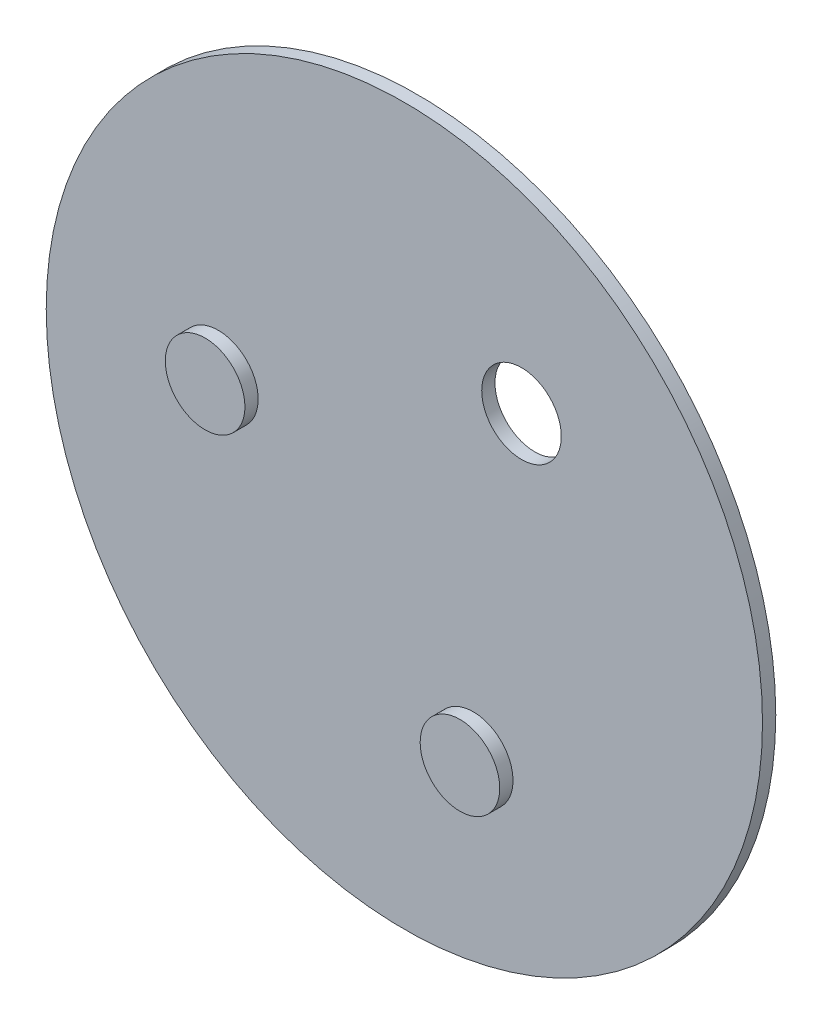
ISO-10303-21;
HEADER;
FILE_DESCRIPTION(('STEP AP214'),'2;1');
FILE_NAME('part.step','',(''),(''),'','','');
FILE_SCHEMA(('AUTOMOTIVE_DESIGN { 1 0 10303 214 1 1 1 1 }'));
ENDSEC;
DATA;
#1=APPLICATION_CONTEXT('core data for automotive mechanical design processes');
#2=APPLICATION_PROTOCOL_DEFINITION('international standard','automotive_design',2000,#1);
#3=PRODUCT_CONTEXT('',#1,'mechanical');
#4=PRODUCT('Part','Part','',(#3));
#5=PRODUCT_RELATED_PRODUCT_CATEGORY('part','',(#4));
#6=PRODUCT_DEFINITION_FORMATION('','',#4);
#7=PRODUCT_DEFINITION_CONTEXT('part definition',#1,'design');
#8=PRODUCT_DEFINITION('design','',#6,#7);
#9=PRODUCT_DEFINITION_SHAPE('','',#8);
#10=(LENGTH_UNIT() NAMED_UNIT(*) SI_UNIT(.MILLI.,.METRE.));
#11=(NAMED_UNIT(*) PLANE_ANGLE_UNIT() SI_UNIT($,.RADIAN.));
#12=(NAMED_UNIT(*) SI_UNIT($,.STERADIAN.) SOLID_ANGLE_UNIT());
#13=UNCERTAINTY_MEASURE_WITH_UNIT(LENGTH_MEASURE(1.E-05),#10,'distance_accuracy_value','');
#14=(GEOMETRIC_REPRESENTATION_CONTEXT(3) GLOBAL_UNCERTAINTY_ASSIGNED_CONTEXT((#13)) GLOBAL_UNIT_ASSIGNED_CONTEXT((#10,
#11,#12)) REPRESENTATION_CONTEXT('',''));
#15=CARTESIAN_POINT('',(0.,0.,0.));
#16=DIRECTION('',(0.,0.,1.));
#17=DIRECTION('',(1.,0.,0.));
#18=AXIS2_PLACEMENT_3D('',#15,#16,#17);
#19=CARTESIAN_POINT('',(-14.0219821608367,2.10189640877717,0.));
#20=DIRECTION('',(0.,0.,-1.));
#21=DIRECTION('',(-1.,0.,0.));
#22=AXIS2_PLACEMENT_3D('',#19,#20,#21);
#23=PLANE('',#22);
#24=CARTESIAN_POINT('',(-14.0219821608367,2.10189640877717,0.));
#25=DIRECTION('',(0.,0.,1.));
#26=DIRECTION('',(1.,0.,0.));
#27=AXIS2_PLACEMENT_3D('',#24,#25,#26);
#28=CIRCLE('',#27,3.0000000000011);
#29=CARTESIAN_POINT('',(-11.0219821608356,2.10189640877717,0.));
#30=VERTEX_POINT('',#29);
#31=EDGE_CURVE('P0_E18',#30,#30,#28,.F.);
#32=ORIENTED_EDGE('',*,*,#31,.F.);
#33=EDGE_LOOP('',(#32));
#34=FACE_BOUND('',#33,.T.);
#35=ADVANCED_FACE('P0_F15',(#34),#23,.F.);
#36=CARTESIAN_POINT('',(-14.0219821608367,2.10189640877717,-1.));
#37=DIRECTION('',(0.,0.,1.));
#38=DIRECTION('',(1.,0.,0.));
#39=AXIS2_PLACEMENT_3D('',#36,#37,#38);
#40=CYLINDRICAL_SURFACE('',#39,3.0000000000011);
#41=ORIENTED_EDGE('',*,*,#31,.T.);
#42=EDGE_LOOP('',(#41));
#43=FACE_BOUND('',#42,.T.);
#44=CARTESIAN_POINT('',(-14.0219821608367,2.10189640877717,-1.));
#45=DIRECTION('',(0.,0.,1.));
#46=DIRECTION('',(1.,0.,0.));
#47=AXIS2_PLACEMENT_3D('',#44,#45,#46);
#48=CIRCLE('',#47,3.0000000000011);
#49=CARTESIAN_POINT('',(-11.0219821608356,2.10189640877717,-1.));
#50=VERTEX_POINT('',#49);
#51=EDGE_CURVE('P0_E10',#50,#50,#48,.F.);
#52=ORIENTED_EDGE('',*,*,#51,.F.);
#53=EDGE_LOOP('',(#52));
#54=FACE_BOUND('',#53,.T.);
#55=ADVANCED_FACE('P0_F27',(#43,#54),#40,.T.);
#56=CARTESIAN_POINT('',(-14.0219821608367,2.10189640877717,-1.));
#57=DIRECTION('',(0.,0.,-1.));
#58=DIRECTION('',(-1.,0.,0.));
#59=AXIS2_PLACEMENT_3D('',#56,#57,#58);
#60=PLANE('',#59);
#61=ORIENTED_EDGE('',*,*,#51,.T.);
#62=EDGE_LOOP('',(#61));
#63=FACE_BOUND('',#62,.T.);
#64=ADVANCED_FACE('P0_F35',(#63),#60,.T.);
#65=CLOSED_SHELL('',(#35,#55,#64));
#66=MANIFOLD_SOLID_BREP('P0_B1',#65);
#67=CARTESIAN_POINT('',(5.19069539429365,-13.1943409670844,2.));
#68=DIRECTION('',(0.,0.,1.));
#69=DIRECTION('',(1.,0.,0.));
#70=AXIS2_PLACEMENT_3D('',#67,#68,#69);
#71=PLANE('',#70);
#72=CARTESIAN_POINT('',(5.19069539429365,-13.1943409670844,2.));
#73=DIRECTION('',(0.,0.,-1.));
#74=DIRECTION('',(-1.,0.,0.));
#75=AXIS2_PLACEMENT_3D('',#72,#73,#74);
#76=CIRCLE('',#75,3.00000000000078);
#77=CARTESIAN_POINT('',(2.19069539429287,-13.1943409670844,2.));
#78=VERTEX_POINT('',#77);
#79=EDGE_CURVE('P1_E18',#78,#78,#76,.T.);
#80=ORIENTED_EDGE('',*,*,#79,.F.);
#81=EDGE_LOOP('',(#80));
#82=FACE_BOUND('',#81,.T.);
#83=ADVANCED_FACE('P1_F15',(#82),#71,.T.);
#84=CARTESIAN_POINT('',(-14.0219821608367,2.10189640877717,2.));
#85=DIRECTION('',(0.,0.,1.));
#86=DIRECTION('',(1.,0.,0.));
#87=AXIS2_PLACEMENT_3D('',#84,#85,#86);
#88=PLANE('',#87);
#89=CARTESIAN_POINT('',(-14.0219821608367,2.10189640877717,2.));
#90=DIRECTION('',(0.,0.,-1.));
#91=DIRECTION('',(-1.,0.,0.));
#92=AXIS2_PLACEMENT_3D('',#89,#90,#91);
#93=CIRCLE('',#92,3.0000000000011);
#94=CARTESIAN_POINT('',(-17.0219821608378,2.10189640877717,2.));
#95=VERTEX_POINT('',#94);
#96=EDGE_CURVE('P1_E40',#95,#95,#93,.T.);
#97=ORIENTED_EDGE('',*,*,#96,.F.);
#98=EDGE_LOOP('',(#97));
#99=FACE_BOUND('',#98,.T.);
#100=ADVANCED_FACE('P1_F50',(#99),#88,.T.);
#101=CARTESIAN_POINT('',(5.19069539429365,-13.1943409670844,2.));
#102=DIRECTION('',(0.,0.,-1.));
#103=DIRECTION('',(-1.,0.,0.));
#104=AXIS2_PLACEMENT_3D('',#101,#102,#103);
#105=CYLINDRICAL_SURFACE('',#104,3.00000000000078);
#106=CARTESIAN_POINT('',(5.19069539429365,-13.1943409670844,0.999999999999999));
#107=DIRECTION('',(0.,0.,-1.));
#108=DIRECTION('',(-1.,0.,0.));
#109=AXIS2_PLACEMENT_3D('',#106,#107,#108);
#110=CIRCLE('',#109,3.00000000000078);
#111=CARTESIAN_POINT('',(2.19069539429287,-13.1943409670844,0.999999999999999));
#112=VERTEX_POINT('',#111);
#113=EDGE_CURVE('P1_E38',#112,#112,#110,.T.);
#114=ORIENTED_EDGE('',*,*,#113,.F.);
#115=EDGE_LOOP('',(#114));
#116=FACE_BOUND('',#115,.T.);
#117=ORIENTED_EDGE('',*,*,#79,.T.);
#118=EDGE_LOOP('',(#117));
#119=FACE_BOUND('',#118,.T.);
#120=ADVANCED_FACE('P1_F47',(#116,#119),#105,.T.);
#121=CARTESIAN_POINT('',(-14.0219821608367,2.10189640877717,2.));
#122=DIRECTION('',(0.,0.,-1.));
#123=DIRECTION('',(-1.,0.,0.));
#124=AXIS2_PLACEMENT_3D('',#121,#122,#123);
#125=CYLINDRICAL_SURFACE('',#124,3.0000000000011);
#126=CARTESIAN_POINT('',(-14.0219821608367,2.10189640877717,0.999999999999999));
#127=DIRECTION('',(0.,0.,-1.));
#128=DIRECTION('',(-1.,0.,0.));
#129=AXIS2_PLACEMENT_3D('',#126,#127,#128);
#130=CIRCLE('',#129,3.0000000000011);
#131=CARTESIAN_POINT('',(-17.0219821608378,2.10189640877717,0.999999999999999));
#132=VERTEX_POINT('',#131);
#133=EDGE_CURVE('P1_E35',#132,#132,#130,.T.);
#134=ORIENTED_EDGE('',*,*,#133,.F.);
#135=EDGE_LOOP('',(#134));
#136=FACE_BOUND('',#135,.T.);
#137=ORIENTED_EDGE('',*,*,#96,.T.);
#138=EDGE_LOOP('',(#137));
#139=FACE_BOUND('',#138,.T.);
#140=ADVANCED_FACE('P1_F75',(#136,#139),#125,.T.);
#141=CARTESIAN_POINT('',(0.,0.,1.));
#142=DIRECTION('',(0.,0.,1.));
#143=DIRECTION('',(1.,0.,0.));
#144=AXIS2_PLACEMENT_3D('',#141,#142,#143);
#145=PLANE('',#144);
#146=CARTESIAN_POINT('',(0.,0.,1.));
#147=DIRECTION('',(0.,0.,-1.));
#148=DIRECTION('',(-1.,0.,0.));
#149=AXIS2_PLACEMENT_3D('',#146,#147,#148);
#150=CIRCLE('',#149,27.);
#151=CARTESIAN_POINT('',(-27.,0.,1.));
#152=VERTEX_POINT('',#151);
#153=EDGE_CURVE('P1_E27',#152,#152,#150,.T.);
#154=ORIENTED_EDGE('',*,*,#153,.F.);
#155=EDGE_LOOP('',(#154));
#156=FACE_BOUND('',#155,.T.);
#157=CARTESIAN_POINT('',(8.83128676654162,11.0924445583084,0.999999999999999));
#158=DIRECTION('',(0.,0.,-1.));
#159=DIRECTION('',(-1.,0.,0.));
#160=AXIS2_PLACEMENT_3D('',#157,#158,#159);
#161=CIRCLE('',#160,2.99999999999999);
#162=CARTESIAN_POINT('',(5.83128676654163,11.0924445583084,0.999999999999999));
#163=VERTEX_POINT('',#162);
#164=EDGE_CURVE('P1_E32',#163,#163,#161,.T.);
#165=ORIENTED_EDGE('',*,*,#164,.T.);
#166=EDGE_LOOP('',(#165));
#167=FACE_BOUND('',#166,.T.);
#168=ORIENTED_EDGE('',*,*,#133,.T.);
#169=EDGE_LOOP('',(#168));
#170=FACE_BOUND('',#169,.T.);
#171=ORIENTED_EDGE('',*,*,#113,.T.);
#172=EDGE_LOOP('',(#171));
#173=FACE_BOUND('',#172,.T.);
#174=ADVANCED_FACE('P1_F71',(#156,#167,#170,#173),#145,.T.);
#175=CARTESIAN_POINT('',(8.83128676654162,11.0924445583084,10.));
#176=DIRECTION('',(0.,0.,-1.));
#177=DIRECTION('',(-1.,0.,0.));
#178=AXIS2_PLACEMENT_3D('',#175,#176,#177);
#179=CYLINDRICAL_SURFACE('',#178,2.99999999999999);
#180=ORIENTED_EDGE('',*,*,#164,.F.);
#181=EDGE_LOOP('',(#180));
#182=FACE_BOUND('',#181,.T.);
#183=CARTESIAN_POINT('',(8.83128676654162,11.0924445583084,0.));
#184=DIRECTION('',(0.,0.,-1.));
#185=DIRECTION('',(-1.,0.,0.));
#186=AXIS2_PLACEMENT_3D('',#183,#184,#185);
#187=CIRCLE('',#186,2.99999999999999);
#188=CARTESIAN_POINT('',(5.83128676654163,11.0924445583084,0.));
#189=VERTEX_POINT('',#188);
#190=EDGE_CURVE('P1_E22',#189,#189,#187,.T.);
#191=ORIENTED_EDGE('',*,*,#190,.T.);
#192=EDGE_LOOP('',(#191));
#193=FACE_BOUND('',#192,.T.);
#194=ADVANCED_FACE('P1_F64',(#182,#193),#179,.F.);
#195=CARTESIAN_POINT('',(0.,0.,1.));
#196=DIRECTION('',(0.,0.,-1.));
#197=DIRECTION('',(-1.,0.,0.));
#198=AXIS2_PLACEMENT_3D('',#195,#196,#197);
#199=CYLINDRICAL_SURFACE('',#198,27.);
#200=ORIENTED_EDGE('',*,*,#153,.T.);
#201=EDGE_LOOP('',(#200));
#202=FACE_BOUND('',#201,.T.);
#203=CARTESIAN_POINT('',(0.,0.,0.));
#204=DIRECTION('',(0.,0.,-1.));
#205=DIRECTION('',(-1.,0.,0.));
#206=AXIS2_PLACEMENT_3D('',#203,#204,#205);
#207=CIRCLE('',#206,27.);
#208=CARTESIAN_POINT('',(-27.,0.,0.));
#209=VERTEX_POINT('',#208);
#210=EDGE_CURVE('P1_E10',#209,#209,#207,.F.);
#211=ORIENTED_EDGE('',*,*,#210,.T.);
#212=EDGE_LOOP('',(#211));
#213=FACE_BOUND('',#212,.T.);
#214=ADVANCED_FACE('P1_F58',(#202,#213),#199,.T.);
#215=CARTESIAN_POINT('',(0.,0.,0.));
#216=DIRECTION('',(0.,0.,1.));
#217=DIRECTION('',(1.,0.,0.));
#218=AXIS2_PLACEMENT_3D('',#215,#216,#217);
#219=PLANE('',#218);
#220=ORIENTED_EDGE('',*,*,#210,.F.);
#221=EDGE_LOOP('',(#220));
#222=FACE_BOUND('',#221,.T.);
#223=ORIENTED_EDGE('',*,*,#190,.F.);
#224=EDGE_LOOP('',(#223));
#225=FACE_BOUND('',#224,.T.);
#226=ADVANCED_FACE('P1_F56',(#222,#225),#219,.F.);
#227=CLOSED_SHELL('',(#83,#100,#120,#140,#174,#194,#214,#226));
#228=MANIFOLD_SOLID_BREP('P1_B1',#227);
#229=CARTESIAN_POINT('',(5.19069539429365,-13.1943409670844,0.));
#230=DIRECTION('',(0.,0.,-1.));
#231=DIRECTION('',(-1.,0.,0.));
#232=AXIS2_PLACEMENT_3D('',#229,#230,#231);
#233=PLANE('',#232);
#234=CARTESIAN_POINT('',(5.19069539429365,-13.1943409670844,0.));
#235=DIRECTION('',(0.,0.,1.));
#236=DIRECTION('',(1.,0.,0.));
#237=AXIS2_PLACEMENT_3D('',#234,#235,#236);
#238=CIRCLE('',#237,3.00000000000078);
#239=CARTESIAN_POINT('',(8.19069539429443,-13.1943409670844,0.));
#240=VERTEX_POINT('',#239);
#241=EDGE_CURVE('P2_E18',#240,#240,#238,.F.);
#242=ORIENTED_EDGE('',*,*,#241,.F.);
#243=EDGE_LOOP('',(#242));
#244=FACE_BOUND('',#243,.T.);
#245=ADVANCED_FACE('P2_F15',(#244),#233,.F.);
#246=CARTESIAN_POINT('',(5.19069539429365,-13.1943409670844,-1.));
#247=DIRECTION('',(0.,0.,1.));
#248=DIRECTION('',(1.,0.,0.));
#249=AXIS2_PLACEMENT_3D('',#246,#247,#248);
#250=CYLINDRICAL_SURFACE('',#249,3.00000000000078);
#251=ORIENTED_EDGE('',*,*,#241,.T.);
#252=EDGE_LOOP('',(#251));
#253=FACE_BOUND('',#252,.T.);
#254=CARTESIAN_POINT('',(5.19069539429365,-13.1943409670844,-1.));
#255=DIRECTION('',(0.,0.,1.));
#256=DIRECTION('',(1.,0.,0.));
#257=AXIS2_PLACEMENT_3D('',#254,#255,#256);
#258=CIRCLE('',#257,3.00000000000078);
#259=CARTESIAN_POINT('',(8.19069539429443,-13.1943409670844,-1.));
#260=VERTEX_POINT('',#259);
#261=EDGE_CURVE('P2_E10',#260,#260,#258,.F.);
#262=ORIENTED_EDGE('',*,*,#261,.F.);
#263=EDGE_LOOP('',(#262));
#264=FACE_BOUND('',#263,.T.);
#265=ADVANCED_FACE('P2_F27',(#253,#264),#250,.T.);
#266=CARTESIAN_POINT('',(5.19069539429365,-13.1943409670844,-1.));
#267=DIRECTION('',(0.,0.,-1.));
#268=DIRECTION('',(-1.,0.,0.));
#269=AXIS2_PLACEMENT_3D('',#266,#267,#268);
#270=PLANE('',#269);
#271=ORIENTED_EDGE('',*,*,#261,.T.);
#272=EDGE_LOOP('',(#271));
#273=FACE_BOUND('',#272,.T.);
#274=ADVANCED_FACE('P2_F35',(#273),#270,.T.);
#275=CLOSED_SHELL('',(#245,#265,#274));
#276=MANIFOLD_SOLID_BREP('P2_B1',#275);
#277=ADVANCED_BREP_SHAPE_REPRESENTATION('',(#18,#66,#228,#276),#14);
#278=SHAPE_DEFINITION_REPRESENTATION(#9,#277);
ENDSEC;
END-ISO-10303-21;
